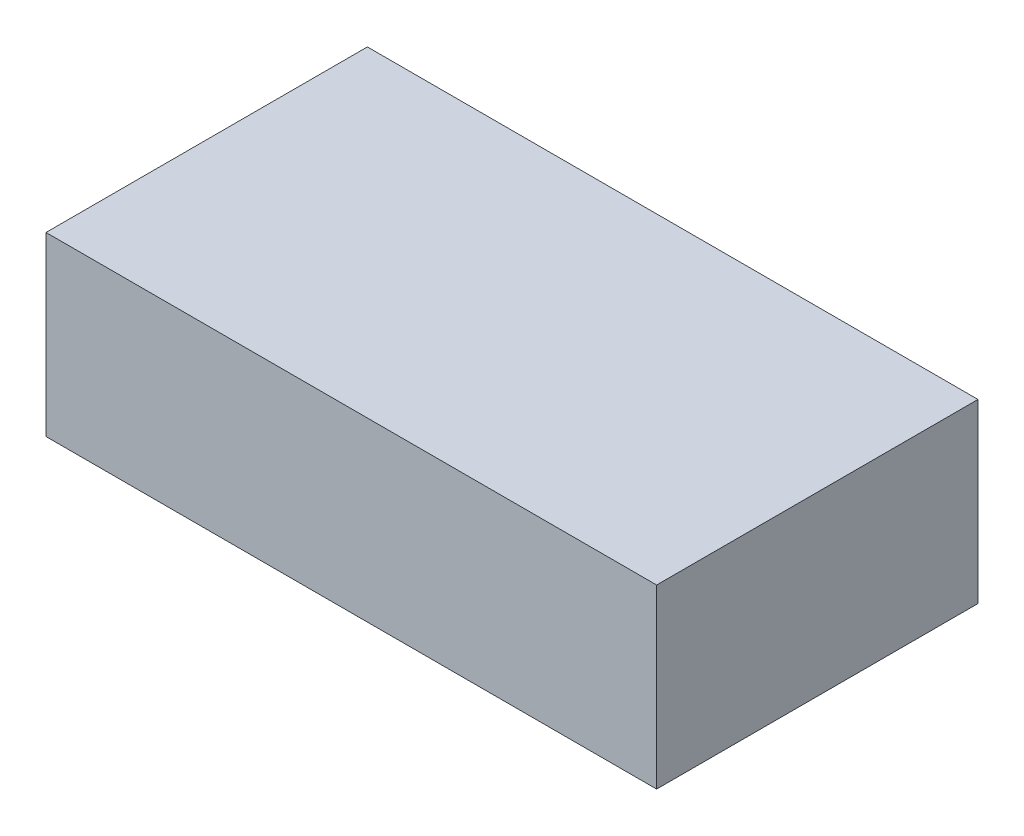
ISO-10303-21;
HEADER;
FILE_DESCRIPTION(('STEP AP214'),'2;1');
FILE_NAME('part.step','',(''),(''),'','','');
FILE_SCHEMA(('AUTOMOTIVE_DESIGN { 1 0 10303 214 1 1 1 1 }'));
ENDSEC;
DATA;
#1=APPLICATION_CONTEXT('core data for automotive mechanical design processes');
#2=APPLICATION_PROTOCOL_DEFINITION('international standard','automotive_design',2000,#1);
#3=PRODUCT_CONTEXT('',#1,'mechanical');
#4=PRODUCT('Part','Part','',(#3));
#5=PRODUCT_RELATED_PRODUCT_CATEGORY('part','',(#4));
#6=PRODUCT_DEFINITION_FORMATION('','',#4);
#7=PRODUCT_DEFINITION_CONTEXT('part definition',#1,'design');
#8=PRODUCT_DEFINITION('design','',#6,#7);
#9=PRODUCT_DEFINITION_SHAPE('','',#8);
#10=(LENGTH_UNIT() NAMED_UNIT(*) SI_UNIT(.MILLI.,.METRE.));
#11=(NAMED_UNIT(*) PLANE_ANGLE_UNIT() SI_UNIT($,.RADIAN.));
#12=(NAMED_UNIT(*) SI_UNIT($,.STERADIAN.) SOLID_ANGLE_UNIT());
#13=UNCERTAINTY_MEASURE_WITH_UNIT(LENGTH_MEASURE(1.E-05),#10,'distance_accuracy_value','');
#14=(GEOMETRIC_REPRESENTATION_CONTEXT(3) GLOBAL_UNCERTAINTY_ASSIGNED_CONTEXT((#13)) GLOBAL_UNIT_ASSIGNED_CONTEXT((#10,
#11,#12)) REPRESENTATION_CONTEXT('',''));
#15=CARTESIAN_POINT('',(0.,0.,0.));
#16=DIRECTION('',(0.,0.,1.));
#17=DIRECTION('',(1.,0.,0.));
#18=AXIS2_PLACEMENT_3D('',#15,#16,#17);
#19=CARTESIAN_POINT('',(0.,22.,0.));
#20=DIRECTION('',(-1.,0.,0.));
#21=DIRECTION('',(0.,0.,1.));
#22=AXIS2_PLACEMENT_3D('',#19,#20,#21);
#23=PLANE('',#22);
#24=DIRECTION('',(0.,0.,-1.));
#25=VECTOR('',#24,1.);
#26=CARTESIAN_POINT('',(0.,0.,0.));
#27=LINE('',#26,#25);
#28=CARTESIAN_POINT('',(0.,0.,40.));
#29=VERTEX_POINT('',#28);
#30=CARTESIAN_POINT('',(0.,0.,0.));
#31=VERTEX_POINT('',#30);
#32=EDGE_CURVE('E97',#29,#31,#27,.T.);
#33=ORIENTED_EDGE('',*,*,#32,.T.);
#34=DIRECTION('',(0.,-1.,0.));
#35=VECTOR('',#34,1.);
#36=CARTESIAN_POINT('',(0.,22.,0.));
#37=LINE('',#36,#35);
#38=CARTESIAN_POINT('',(0.,22.,0.));
#39=VERTEX_POINT('',#38);
#40=EDGE_CURVE('E11',#39,#31,#37,.T.);
#41=ORIENTED_EDGE('',*,*,#40,.F.);
#42=DIRECTION('',(0.,0.,-1.));
#43=VECTOR('',#42,1.);
#44=CARTESIAN_POINT('',(0.,22.,0.));
#45=LINE('',#44,#43);
#46=CARTESIAN_POINT('',(0.,22.,40.));
#47=VERTEX_POINT('',#46);
#48=EDGE_CURVE('E85',#47,#39,#45,.T.);
#49=ORIENTED_EDGE('',*,*,#48,.F.);
#50=DIRECTION('',(0.,-1.,0.));
#51=VECTOR('',#50,1.);
#52=CARTESIAN_POINT('',(0.,22.,40.));
#53=LINE('',#52,#51);
#54=EDGE_CURVE('E93',#47,#29,#53,.T.);
#55=ORIENTED_EDGE('',*,*,#54,.T.);
#56=EDGE_LOOP('',(#33,#41,#49,#55));
#57=FACE_BOUND('',#56,.T.);
#58=ADVANCED_FACE('F34',(#57),#23,.F.);
#59=CARTESIAN_POINT('',(0.,22.,0.));
#60=DIRECTION('',(0.,0.,1.));
#61=DIRECTION('',(1.,0.,0.));
#62=AXIS2_PLACEMENT_3D('',#59,#60,#61);
#63=PLANE('',#62);
#64=DIRECTION('',(-1.,0.,0.));
#65=VECTOR('',#64,1.);
#66=CARTESIAN_POINT('',(0.,0.,0.));
#67=LINE('',#66,#65);
#68=CARTESIAN_POINT('',(-76.,0.,0.));
#69=VERTEX_POINT('',#68);
#70=EDGE_CURVE('E89',#31,#69,#67,.T.);
#71=ORIENTED_EDGE('',*,*,#70,.T.);
#72=DIRECTION('',(0.,-1.,0.));
#73=VECTOR('',#72,1.);
#74=CARTESIAN_POINT('',(-76.,22.,0.));
#75=LINE('',#74,#73);
#76=CARTESIAN_POINT('',(-76.,22.,0.));
#77=VERTEX_POINT('',#76);
#78=EDGE_CURVE('E42',#77,#69,#75,.T.);
#79=ORIENTED_EDGE('',*,*,#78,.F.);
#80=DIRECTION('',(-1.,0.,0.));
#81=VECTOR('',#80,1.);
#82=CARTESIAN_POINT('',(0.,22.,0.));
#83=LINE('',#82,#81);
#84=EDGE_CURVE('E80',#39,#77,#83,.T.);
#85=ORIENTED_EDGE('',*,*,#84,.F.);
#86=ORIENTED_EDGE('',*,*,#40,.T.);
#87=EDGE_LOOP('',(#71,#79,#85,#86));
#88=FACE_BOUND('',#87,.T.);
#89=ADVANCED_FACE('F88',(#88),#63,.F.);
#90=CARTESIAN_POINT('',(-76.,22.,0.));
#91=DIRECTION('',(1.,0.,0.));
#92=DIRECTION('',(0.,0.,-1.));
#93=AXIS2_PLACEMENT_3D('',#90,#91,#92);
#94=PLANE('',#93);
#95=DIRECTION('',(0.,0.,1.));
#96=VECTOR('',#95,1.);
#97=CARTESIAN_POINT('',(-76.,0.,0.));
#98=LINE('',#97,#96);
#99=CARTESIAN_POINT('',(-76.,0.,40.));
#100=VERTEX_POINT('',#99);
#101=EDGE_CURVE('E67',#69,#100,#98,.T.);
#102=ORIENTED_EDGE('',*,*,#101,.T.);
#103=DIRECTION('',(0.,-1.,0.));
#104=VECTOR('',#103,1.);
#105=CARTESIAN_POINT('',(-76.,22.,40.));
#106=LINE('',#105,#104);
#107=CARTESIAN_POINT('',(-76.,22.,40.));
#108=VERTEX_POINT('',#107);
#109=EDGE_CURVE('E90',#108,#100,#106,.T.);
#110=ORIENTED_EDGE('',*,*,#109,.F.);
#111=DIRECTION('',(0.,0.,1.));
#112=VECTOR('',#111,1.);
#113=CARTESIAN_POINT('',(-76.,22.,0.));
#114=LINE('',#113,#112);
#115=EDGE_CURVE('E83',#77,#108,#114,.T.);
#116=ORIENTED_EDGE('',*,*,#115,.F.);
#117=ORIENTED_EDGE('',*,*,#78,.T.);
#118=EDGE_LOOP('',(#102,#110,#116,#117));
#119=FACE_BOUND('',#118,.T.);
#120=ADVANCED_FACE('F91',(#119),#94,.F.);
#121=CARTESIAN_POINT('',(0.,22.,40.));
#122=DIRECTION('',(0.,0.,-1.));
#123=DIRECTION('',(-1.,0.,0.));
#124=AXIS2_PLACEMENT_3D('',#121,#122,#123);
#125=PLANE('',#124);
#126=DIRECTION('',(1.,0.,0.));
#127=VECTOR('',#126,1.);
#128=CARTESIAN_POINT('',(0.,0.,40.));
#129=LINE('',#128,#127);
#130=EDGE_CURVE('E73',#100,#29,#129,.T.);
#131=ORIENTED_EDGE('',*,*,#130,.T.);
#132=ORIENTED_EDGE('',*,*,#54,.F.);
#133=DIRECTION('',(1.,0.,0.));
#134=VECTOR('',#133,1.);
#135=CARTESIAN_POINT('',(0.,22.,40.));
#136=LINE('',#135,#134);
#137=EDGE_CURVE('E50',#108,#47,#136,.T.);
#138=ORIENTED_EDGE('',*,*,#137,.F.);
#139=ORIENTED_EDGE('',*,*,#109,.T.);
#140=EDGE_LOOP('',(#131,#132,#138,#139));
#141=FACE_BOUND('',#140,.T.);
#142=ADVANCED_FACE('F104',(#141),#125,.F.);
#143=CARTESIAN_POINT('',(0.,22.,0.));
#144=DIRECTION('',(0.,-1.,0.));
#145=DIRECTION('',(0.,0.,-1.));
#146=AXIS2_PLACEMENT_3D('',#143,#144,#145);
#147=PLANE('',#146);
#148=ORIENTED_EDGE('',*,*,#48,.T.);
#149=ORIENTED_EDGE('',*,*,#84,.T.);
#150=ORIENTED_EDGE('',*,*,#115,.T.);
#151=ORIENTED_EDGE('',*,*,#137,.T.);
#152=EDGE_LOOP('',(#148,#149,#150,#151));
#153=FACE_BOUND('',#152,.T.);
#154=ADVANCED_FACE('F81',(#153),#147,.F.);
#155=CARTESIAN_POINT('',(0.,0.,0.));
#156=DIRECTION('',(0.,-1.,0.));
#157=DIRECTION('',(0.,0.,-1.));
#158=AXIS2_PLACEMENT_3D('',#155,#156,#157);
#159=PLANE('',#158);
#160=ORIENTED_EDGE('',*,*,#32,.F.);
#161=ORIENTED_EDGE('',*,*,#130,.F.);
#162=ORIENTED_EDGE('',*,*,#101,.F.);
#163=ORIENTED_EDGE('',*,*,#70,.F.);
#164=EDGE_LOOP('',(#160,#161,#162,#163));
#165=FACE_BOUND('',#164,.T.);
#166=ADVANCED_FACE('F107',(#165),#159,.T.);
#167=CLOSED_SHELL('',(#58,#89,#120,#142,#154,#166));
#168=MANIFOLD_SOLID_BREP('B2',#167);
#169=ADVANCED_BREP_SHAPE_REPRESENTATION('',(#18,#168),#14);
#170=SHAPE_DEFINITION_REPRESENTATION(#9,#169);
ENDSEC;
END-ISO-10303-21;
